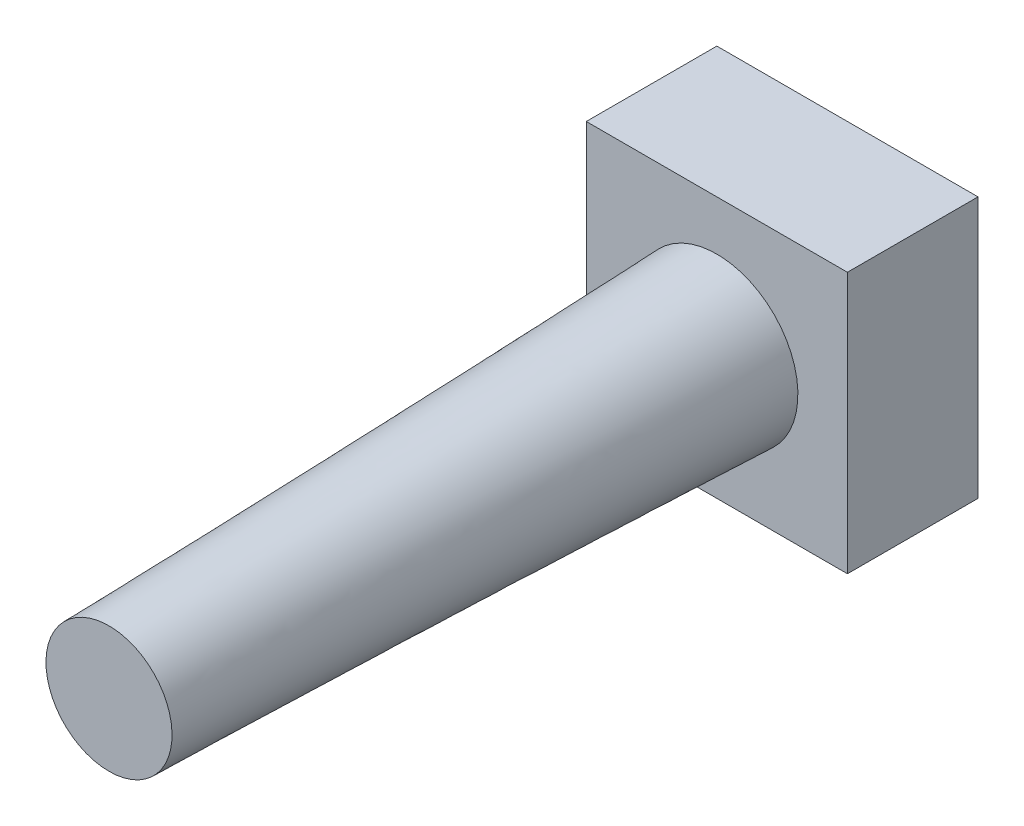
ISO-10303-21;
HEADER;
FILE_DESCRIPTION(('STEP AP214'),'2;1');
FILE_NAME('part.step','',(''),(''),'','','');
FILE_SCHEMA(('AUTOMOTIVE_DESIGN { 1 0 10303 214 1 1 1 1 }'));
ENDSEC;
DATA;
#1=APPLICATION_CONTEXT('core data for automotive mechanical design processes');
#2=APPLICATION_PROTOCOL_DEFINITION('international standard','automotive_design',2000,#1);
#3=PRODUCT_CONTEXT('',#1,'mechanical');
#4=PRODUCT('Part','Part','',(#3));
#5=PRODUCT_RELATED_PRODUCT_CATEGORY('part','',(#4));
#6=PRODUCT_DEFINITION_FORMATION('','',#4);
#7=PRODUCT_DEFINITION_CONTEXT('part definition',#1,'design');
#8=PRODUCT_DEFINITION('design','',#6,#7);
#9=PRODUCT_DEFINITION_SHAPE('','',#8);
#10=(LENGTH_UNIT() NAMED_UNIT(*) SI_UNIT(.MILLI.,.METRE.));
#11=(NAMED_UNIT(*) PLANE_ANGLE_UNIT() SI_UNIT($,.RADIAN.));
#12=(NAMED_UNIT(*) SI_UNIT($,.STERADIAN.) SOLID_ANGLE_UNIT());
#13=UNCERTAINTY_MEASURE_WITH_UNIT(LENGTH_MEASURE(1.E-05),#10,'distance_accuracy_value','');
#14=(GEOMETRIC_REPRESENTATION_CONTEXT(3) GLOBAL_UNCERTAINTY_ASSIGNED_CONTEXT((#13)) GLOBAL_UNIT_ASSIGNED_CONTEXT((#10,
#11,#12)) REPRESENTATION_CONTEXT('',''));
#15=CARTESIAN_POINT('',(0.,0.,0.));
#16=DIRECTION('',(0.,0.,1.));
#17=DIRECTION('',(1.,0.,0.));
#18=AXIS2_PLACEMENT_3D('',#15,#16,#17);
#19=CARTESIAN_POINT('',(0.,0.,2.9));
#20=DIRECTION('',(0.,0.,1.));
#21=DIRECTION('',(1.,0.,0.));
#22=AXIS2_PLACEMENT_3D('',#19,#20,#21);
#23=PLANE('',#22);
#24=DIRECTION('',(0.,-1.,0.));
#25=VECTOR('',#24,1.);
#26=CARTESIAN_POINT('',(-2.9,-2.9,2.9));
#27=LINE('',#26,#25);
#28=CARTESIAN_POINT('',(-2.9,2.9,2.9));
#29=VERTEX_POINT('',#28);
#30=CARTESIAN_POINT('',(-2.9,-2.9,2.9));
#31=VERTEX_POINT('',#30);
#32=EDGE_CURVE('E89',#29,#31,#27,.T.);
#33=ORIENTED_EDGE('',*,*,#32,.T.);
#34=DIRECTION('',(1.,0.,0.));
#35=VECTOR('',#34,1.);
#36=CARTESIAN_POINT('',(2.9,-2.9,2.9));
#37=LINE('',#36,#35);
#38=CARTESIAN_POINT('',(2.9,-2.9,2.9));
#39=VERTEX_POINT('',#38);
#40=EDGE_CURVE('E84',#31,#39,#37,.T.);
#41=ORIENTED_EDGE('',*,*,#40,.T.);
#42=DIRECTION('',(0.,1.,0.));
#43=VECTOR('',#42,1.);
#44=CARTESIAN_POINT('',(2.9,-2.9,2.9));
#45=LINE('',#44,#43);
#46=CARTESIAN_POINT('',(2.9,2.9,2.9));
#47=VERTEX_POINT('',#46);
#48=EDGE_CURVE('E87',#39,#47,#45,.T.);
#49=ORIENTED_EDGE('',*,*,#48,.T.);
#50=DIRECTION('',(-1.,0.,0.));
#51=VECTOR('',#50,1.);
#52=CARTESIAN_POINT('',(2.9,2.9,2.9));
#53=LINE('',#52,#51);
#54=EDGE_CURVE('E54',#47,#29,#53,.T.);
#55=ORIENTED_EDGE('',*,*,#54,.T.);
#56=EDGE_LOOP('',(#33,#41,#49,#55));
#57=FACE_BOUND('',#56,.T.);
#58=CARTESIAN_POINT('',(0.,0.,2.9));
#59=DIRECTION('',(0.,0.,1.));
#60=DIRECTION('',(1.,0.,0.));
#61=AXIS2_PLACEMENT_3D('',#58,#59,#60);
#62=CIRCLE('',#61,1.8);
#63=CARTESIAN_POINT('',(1.548183001048,0.918220776973604,2.9));
#64=VERTEX_POINT('',#63);
#65=EDGE_CURVE('E104',#64,#64,#62,.T.);
#66=ORIENTED_EDGE('',*,*,#65,.F.);
#67=EDGE_LOOP('',(#66));
#68=FACE_BOUND('',#67,.T.);
#69=ADVANCED_FACE('F37',(#57,#68),#23,.T.);
#70=CARTESIAN_POINT('',(-2.9,-2.9,2.9));
#71=DIRECTION('',(1.,0.,0.));
#72=DIRECTION('',(0.,0.,-1.));
#73=AXIS2_PLACEMENT_3D('',#70,#71,#72);
#74=PLANE('',#73);
#75=DIRECTION('',(0.,-1.,0.));
#76=VECTOR('',#75,1.);
#77=CARTESIAN_POINT('',(-2.9,-2.9,0.));
#78=LINE('',#77,#76);
#79=CARTESIAN_POINT('',(-2.9,2.9,0.));
#80=VERTEX_POINT('',#79);
#81=CARTESIAN_POINT('',(-2.9,-2.9,0.));
#82=VERTEX_POINT('',#81);
#83=EDGE_CURVE('E101',#80,#82,#78,.T.);
#84=ORIENTED_EDGE('',*,*,#83,.T.);
#85=DIRECTION('',(0.,0.,-1.));
#86=VECTOR('',#85,1.);
#87=CARTESIAN_POINT('',(-2.9,-2.9,2.9));
#88=LINE('',#87,#86);
#89=EDGE_CURVE('E12',#31,#82,#88,.T.);
#90=ORIENTED_EDGE('',*,*,#89,.F.);
#91=ORIENTED_EDGE('',*,*,#32,.F.);
#92=DIRECTION('',(0.,0.,-1.));
#93=VECTOR('',#92,1.);
#94=CARTESIAN_POINT('',(-2.9,2.9,2.9));
#95=LINE('',#94,#93);
#96=EDGE_CURVE('E97',#29,#80,#95,.T.);
#97=ORIENTED_EDGE('',*,*,#96,.T.);
#98=EDGE_LOOP('',(#84,#90,#91,#97));
#99=FACE_BOUND('',#98,.T.);
#100=ADVANCED_FACE('F39',(#99),#74,.F.);
#101=CARTESIAN_POINT('',(2.9,-2.9,2.9));
#102=DIRECTION('',(0.,1.,0.));
#103=DIRECTION('',(-1.,0.,0.));
#104=AXIS2_PLACEMENT_3D('',#101,#102,#103);
#105=PLANE('',#104);
#106=DIRECTION('',(1.,0.,0.));
#107=VECTOR('',#106,1.);
#108=CARTESIAN_POINT('',(2.9,-2.9,0.));
#109=LINE('',#108,#107);
#110=CARTESIAN_POINT('',(2.9,-2.9,0.));
#111=VERTEX_POINT('',#110);
#112=EDGE_CURVE('E93',#82,#111,#109,.T.);
#113=ORIENTED_EDGE('',*,*,#112,.T.);
#114=DIRECTION('',(0.,0.,-1.));
#115=VECTOR('',#114,1.);
#116=CARTESIAN_POINT('',(2.9,-2.9,2.9));
#117=LINE('',#116,#115);
#118=EDGE_CURVE('E46',#39,#111,#117,.T.);
#119=ORIENTED_EDGE('',*,*,#118,.F.);
#120=ORIENTED_EDGE('',*,*,#40,.F.);
#121=ORIENTED_EDGE('',*,*,#89,.T.);
#122=EDGE_LOOP('',(#113,#119,#120,#121));
#123=FACE_BOUND('',#122,.T.);
#124=ADVANCED_FACE('F92',(#123),#105,.F.);
#125=CARTESIAN_POINT('',(2.9,-2.9,2.9));
#126=DIRECTION('',(-1.,0.,0.));
#127=DIRECTION('',(0.,0.,1.));
#128=AXIS2_PLACEMENT_3D('',#125,#126,#127);
#129=PLANE('',#128);
#130=DIRECTION('',(0.,1.,0.));
#131=VECTOR('',#130,1.);
#132=CARTESIAN_POINT('',(2.9,-2.9,0.));
#133=LINE('',#132,#131);
#134=CARTESIAN_POINT('',(2.9,2.9,0.));
#135=VERTEX_POINT('',#134);
#136=EDGE_CURVE('E71',#111,#135,#133,.T.);
#137=ORIENTED_EDGE('',*,*,#136,.T.);
#138=DIRECTION('',(0.,0.,-1.));
#139=VECTOR('',#138,1.);
#140=CARTESIAN_POINT('',(2.9,2.9,2.9));
#141=LINE('',#140,#139);
#142=EDGE_CURVE('E94',#47,#135,#141,.T.);
#143=ORIENTED_EDGE('',*,*,#142,.F.);
#144=ORIENTED_EDGE('',*,*,#48,.F.);
#145=ORIENTED_EDGE('',*,*,#118,.T.);
#146=EDGE_LOOP('',(#137,#143,#144,#145));
#147=FACE_BOUND('',#146,.T.);
#148=ADVANCED_FACE('F95',(#147),#129,.F.);
#149=CARTESIAN_POINT('',(2.9,2.9,2.9));
#150=DIRECTION('',(0.,-1.,0.));
#151=DIRECTION('',(1.,0.,0.));
#152=AXIS2_PLACEMENT_3D('',#149,#150,#151);
#153=PLANE('',#152);
#154=DIRECTION('',(-1.,0.,0.));
#155=VECTOR('',#154,1.);
#156=CARTESIAN_POINT('',(2.9,2.9,0.));
#157=LINE('',#156,#155);
#158=EDGE_CURVE('E77',#135,#80,#157,.T.);
#159=ORIENTED_EDGE('',*,*,#158,.T.);
#160=ORIENTED_EDGE('',*,*,#96,.F.);
#161=ORIENTED_EDGE('',*,*,#54,.F.);
#162=ORIENTED_EDGE('',*,*,#142,.T.);
#163=EDGE_LOOP('',(#159,#160,#161,#162));
#164=FACE_BOUND('',#163,.T.);
#165=ADVANCED_FACE('F109',(#164),#153,.F.);
#166=CARTESIAN_POINT('',(0.,0.,0.));
#167=DIRECTION('',(0.,0.,1.));
#168=DIRECTION('',(1.,0.,0.));
#169=AXIS2_PLACEMENT_3D('',#166,#167,#168);
#170=PLANE('',#169);
#171=ORIENTED_EDGE('',*,*,#83,.F.);
#172=ORIENTED_EDGE('',*,*,#158,.F.);
#173=ORIENTED_EDGE('',*,*,#136,.F.);
#174=ORIENTED_EDGE('',*,*,#112,.F.);
#175=EDGE_LOOP('',(#171,#172,#173,#174));
#176=FACE_BOUND('',#175,.T.);
#177=ADVANCED_FACE('F112',(#176),#170,.F.);
#178=CARTESIAN_POINT('',(0.,0.,16.4));
#179=DIRECTION('',(0.,0.,1.));
#180=DIRECTION('',(1.,0.,0.));
#181=AXIS2_PLACEMENT_3D('',#178,#179,#180);
#182=PLANE('',#181);
#183=CARTESIAN_POINT('',(0.,0.,16.4));
#184=DIRECTION('',(0.,0.,1.));
#185=DIRECTION('',(1.,0.,0.));
#186=AXIS2_PLACEMENT_3D('',#183,#184,#185);
#187=CIRCLE('',#186,1.4);
#188=CARTESIAN_POINT('',(0.877386601201805,1.0909595556351,16.4));
#189=VERTEX_POINT('',#188);
#190=EDGE_CURVE('E117',#189,#189,#187,.T.);
#191=ORIENTED_EDGE('',*,*,#190,.T.);
#192=EDGE_LOOP('',(#191));
#193=FACE_BOUND('',#192,.T.);
#194=ADVANCED_FACE('F127',(#193),#182,.T.);
#195=CARTESIAN_POINT('',(0.877386601201805,1.0909595556351,16.4));
#196=CARTESIAN_POINT('',(1.548183001048,0.918220776973604,2.9));
#197=CARTESIAN_POINT('',(3.05930571247201,-0.663813646768506,16.4));
#198=CARTESIAN_POINT('',(3.38462455499521,-2.17814522512239,2.9));
#199=CARTESIAN_POINT('',(1.3045325100684,-2.84573275803871,16.4));
#200=CARTESIAN_POINT('',(0.288258552899208,-4.0145867790696,2.9));
#201=CARTESIAN_POINT('',(-0.877386601201805,-1.0909595556351,16.4));
#202=CARTESIAN_POINT('',(-1.548183001048,-0.918220776973604,2.9));
#203=CARTESIAN_POINT('',(-3.05930571247201,0.663813646768506,16.4));
#204=CARTESIAN_POINT('',(-3.38462455499521,2.17814522512239,2.9));
#205=CARTESIAN_POINT('',(-1.3045325100684,2.84573275803871,16.4));
#206=CARTESIAN_POINT('',(-0.288258552899208,4.0145867790696,2.9));
#207=CARTESIAN_POINT('',(0.877386601201805,1.0909595556351,16.4));
#208=CARTESIAN_POINT('',(1.548183001048,0.918220776973604,2.9));
#209=(BOUNDED_SURFACE() B_SPLINE_SURFACE(3,1,((#195,#196),(#197,#198),(#199,#200),(#201,#202),
(#203,#204),(#205,#206),(#207,#208)),.UNSPECIFIED.,.T.,.F.,.F.) B_SPLINE_SURFACE_WITH_KNOTS((4,
3,4),(2,2),(0.,0.5,1.),(0.,1.),
.UNSPECIFIED.) GEOMETRIC_REPRESENTATION_ITEM() RATIONAL_B_SPLINE_SURFACE(((1.,1.),
(0.333333333333333,0.333333333333333),(0.333333333333333,0.333333333333333),(1.,1.),
(0.333333333333333,0.333333333333333),(0.333333333333333,0.333333333333333),(1.,1.))) REPRESENTATION_ITEM('') SURFACE());
#210=CARTESIAN_POINT('',(0.877386601201805,1.0909595556351,16.4));
#211=CARTESIAN_POINT('',(0.884374063700203,1.08916019335738,16.259375));
#212=CARTESIAN_POINT('',(0.891361526198601,1.08736083107966,16.11875));
#213=CARTESIAN_POINT('',(0.905336451195397,1.08376210652421,15.8375));
#214=CARTESIAN_POINT('',(0.912323913693795,1.08196274424648,15.696875));
#215=CARTESIAN_POINT('',(0.92629883869059,1.07836401969104,15.415625));
#216=CARTESIAN_POINT('',(0.933286301188988,1.07656465741331,15.275));
#217=CARTESIAN_POINT('',(0.947261226185784,1.07296593285786,14.99375));
#218=CARTESIAN_POINT('',(0.954248688684182,1.07116657058014,14.853125));
#219=CARTESIAN_POINT('',(0.968223613680977,1.06756784602469,14.571875));
#220=CARTESIAN_POINT('',(0.975211076179375,1.06576848374697,14.43125));
#221=CARTESIAN_POINT('',(0.989186001176171,1.06216975919152,14.15));
#222=CARTESIAN_POINT('',(0.996173463674569,1.0603703969138,14.009375));
#223=CARTESIAN_POINT('',(1.01014838867136,1.05677167235835,13.728125));
#224=CARTESIAN_POINT('',(1.01713585116976,1.05497231008063,13.5875));
#225=CARTESIAN_POINT('',(1.03111077616656,1.05137358552518,13.30625));
#226=CARTESIAN_POINT('',(1.03809823866496,1.04957422324745,13.165625));
#227=CARTESIAN_POINT('',(1.05207316366175,1.04597549869201,12.884375));
#228=CARTESIAN_POINT('',(1.05906062616015,1.04417613641428,12.74375));
#229=CARTESIAN_POINT('',(1.07303555115695,1.04057741185883,12.4625));
#230=CARTESIAN_POINT('',(1.08002301365534,1.03877804958111,12.321875));
#231=CARTESIAN_POINT('',(1.09399793865214,1.03517932502566,12.040625));
#232=CARTESIAN_POINT('',(1.10098540115054,1.03337996274794,11.9));
#233=CARTESIAN_POINT('',(1.11496032614733,1.02978123819249,11.61875));
#234=CARTESIAN_POINT('',(1.12194778864573,1.02798187591477,11.478125));
#235=CARTESIAN_POINT('',(1.13592271364253,1.02438315135932,11.196875));
#236=CARTESIAN_POINT('',(1.14291017614092,1.02258378908159,11.05625));
#237=CARTESIAN_POINT('',(1.15688510113772,1.01898506452615,10.775));
#238=CARTESIAN_POINT('',(1.16387256363612,1.01718570224842,10.634375));
#239=CARTESIAN_POINT('',(1.17784748863291,1.01358697769297,10.353125));
#240=CARTESIAN_POINT('',(1.18483495113131,1.01178761541525,10.2125));
#241=CARTESIAN_POINT('',(1.19880987612811,1.0081888908598,9.93125));
#242=CARTESIAN_POINT('',(1.2057973386265,1.00638952858208,9.790625));
#243=CARTESIAN_POINT('',(1.2197722636233,1.00279080402663,9.509375));
#244=CARTESIAN_POINT('',(1.2267597261217,1.00099144174891,9.36875));
#245=CARTESIAN_POINT('',(1.24073465111849,0.997392717193459,9.0875));
#246=CARTESIAN_POINT('',(1.24772211361689,0.995593354915735,8.946875));
#247=CARTESIAN_POINT('',(1.26169703861369,0.991994630360287,8.665625));
#248=CARTESIAN_POINT('',(1.26868450111209,0.990195268082563,8.525));
#249=CARTESIAN_POINT('',(1.28265942610888,0.986596543527115,8.24375));
#250=CARTESIAN_POINT('',(1.28964688860728,0.984797181249391,8.103125));
#251=CARTESIAN_POINT('',(1.30362181360407,0.981198456693943,7.821875));
#252=CARTESIAN_POINT('',(1.31060927610247,0.979399094416219,7.68125));
#253=CARTESIAN_POINT('',(1.32458420109927,0.975800369860771,7.4));
#254=CARTESIAN_POINT('',(1.33157166359767,0.974001007583047,7.259375));
#255=CARTESIAN_POINT('',(1.34554658859446,0.970402283027599,6.978125));
#256=CARTESIAN_POINT('',(1.35253405109286,0.968602920749875,6.8375));
#257=CARTESIAN_POINT('',(1.36650897608966,0.965004196194427,6.55625));
#258=CARTESIAN_POINT('',(1.37349643858805,0.963204833916703,6.415625));
#259=CARTESIAN_POINT('',(1.38747136358485,0.959606109361255,6.134375));
#260=CARTESIAN_POINT('',(1.39445882608325,0.957806747083531,5.99375));
#261=CARTESIAN_POINT('',(1.40843375108004,0.954208022528083,5.7125));
#262=CARTESIAN_POINT('',(1.41542121357844,0.95240866025036,5.571875));
#263=CARTESIAN_POINT('',(1.42939613857524,0.948809935694912,5.290625));
#264=CARTESIAN_POINT('',(1.43638360107363,0.947010573417188,5.15));
#265=CARTESIAN_POINT('',(1.45035852607043,0.94341184886174,4.86875));
#266=CARTESIAN_POINT('',(1.45734598856883,0.941612486584016,4.728125));
#267=CARTESIAN_POINT('',(1.47132091356562,0.938013762028568,4.446875));
#268=CARTESIAN_POINT('',(1.47830837606402,0.936214399750844,4.30625));
#269=CARTESIAN_POINT('',(1.49228330106082,0.932615675195396,4.025));
#270=CARTESIAN_POINT('',(1.49927076355921,0.930816312917672,3.884375));
#271=CARTESIAN_POINT('',(1.51324568855601,0.927217588362224,3.603125));
#272=CARTESIAN_POINT('',(1.52023315105441,0.9254182260845,3.4625));
#273=CARTESIAN_POINT('',(1.5342080760512,0.921819501529052,3.18125));
#274=CARTESIAN_POINT('',(1.5411955385496,0.920020139251328,3.040625));
#275=CARTESIAN_POINT('',(1.548183001048,0.918220776973604,2.9));
#276=B_SPLINE_CURVE_WITH_KNOTS('',3,(#210,#211,#212,#213,#214,#215,#216,#217,#218,#219,#220,
#221,#222,#223,#224,#225,#226,#227,#228,#229,#230,#231,#232,#233,#234,#235,#236,#237,#238,#239,
#240,#241,#242,#243,#244,#245,#246,#247,#248,#249,#250,#251,#252,#253,#254,#255,#256,#257,#258,
#259,#260,#261,#262,#263,#264,#265,#266,#267,#268,#269,#270,#271,#272,#273,#274,#275),
.UNSPECIFIED.,.F.,.F.,(4,2,2,2,2,2,2,2,2,2,2,2,2,2,2,2,2,2,2,2,2,2,2,2,2,2,2,2,2,2,2,2,4),(0.,
0.422429966569556,0.844859933139115,1.26728989970867,1.68971986627823,2.11214983284778,
2.53457979941734,2.9570097659869,3.37943973255646,3.80186969912601,4.22429966569557,
4.64672963226513,5.06915959883468,5.49158956540424,5.9140195319738,6.33644949854335,
6.75887946511291,7.18130943168247,7.60373939825202,8.02616936482158,8.44859933139114,
8.87102929796069,9.29345926453025,9.71588923109981,10.1383191976694,10.5607491642389,
10.9831791308085,11.405609097378,11.8280390639476,12.2504690305172,12.6728989970867,
13.0953289636563,13.5177589302258),.UNSPECIFIED.);
#277=EDGE_CURVE('BSEAM136',#189,#64,#276,.T.);
#278=ORIENTED_EDGE('',*,*,#190,.F.);
#279=ORIENTED_EDGE('',*,*,#65,.T.);
#280=ORIENTED_EDGE('',*,*,#277,.T.);
#281=ORIENTED_EDGE('',*,*,#277,.F.);
#282=EDGE_LOOP('',(#278,#280,#279,#281));
#283=FACE_BOUND('',#282,.T.);
#284=ADVANCED_FACE('F136',(#283),#209,.T.);
#285=CLOSED_SHELL('',(#69,#100,#124,#148,#165,#177,#194,#284));
#286=MANIFOLD_SOLID_BREP('B2',#285);
#287=ADVANCED_BREP_SHAPE_REPRESENTATION('',(#18,#286),#14);
#288=SHAPE_DEFINITION_REPRESENTATION(#9,#287);
ENDSEC;
END-ISO-10303-21;
